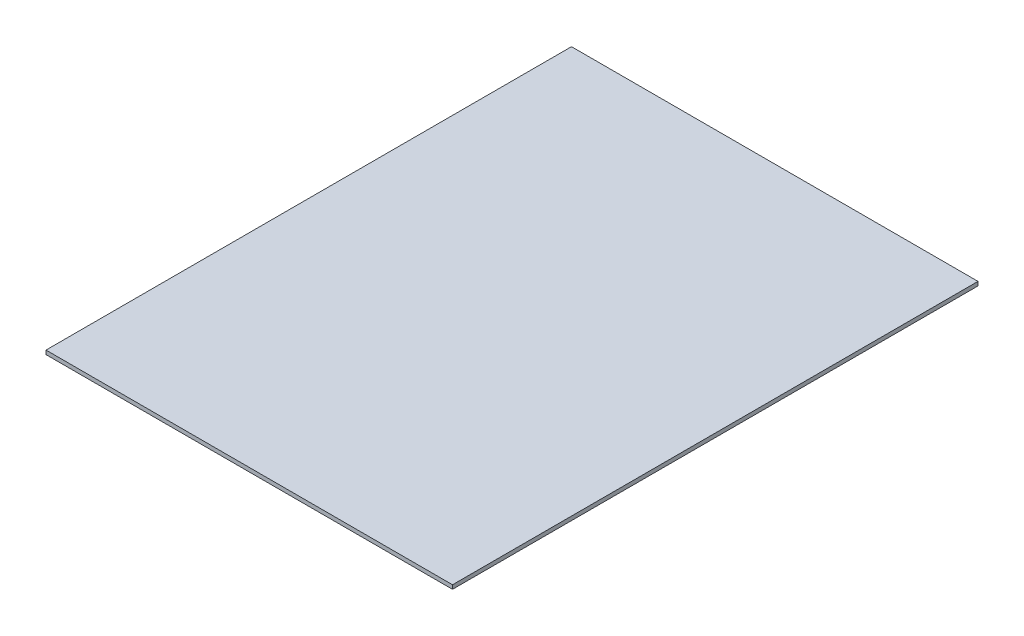
ISO-10303-21;
HEADER;
FILE_DESCRIPTION(('STEP AP214'),'2;1');
FILE_NAME('part.step','',(''),(''),'','','');
FILE_SCHEMA(('AUTOMOTIVE_DESIGN { 1 0 10303 214 1 1 1 1 }'));
ENDSEC;
DATA;
#1=APPLICATION_CONTEXT('core data for automotive mechanical design processes');
#2=APPLICATION_PROTOCOL_DEFINITION('international standard','automotive_design',2000,#1);
#3=PRODUCT_CONTEXT('',#1,'mechanical');
#4=PRODUCT('Part','Part','',(#3));
#5=PRODUCT_RELATED_PRODUCT_CATEGORY('part','',(#4));
#6=PRODUCT_DEFINITION_FORMATION('','',#4);
#7=PRODUCT_DEFINITION_CONTEXT('part definition',#1,'design');
#8=PRODUCT_DEFINITION('design','',#6,#7);
#9=PRODUCT_DEFINITION_SHAPE('','',#8);
#10=(LENGTH_UNIT() NAMED_UNIT(*) SI_UNIT(.MILLI.,.METRE.));
#11=(NAMED_UNIT(*) PLANE_ANGLE_UNIT() SI_UNIT($,.RADIAN.));
#12=(NAMED_UNIT(*) SI_UNIT($,.STERADIAN.) SOLID_ANGLE_UNIT());
#13=UNCERTAINTY_MEASURE_WITH_UNIT(LENGTH_MEASURE(1.E-05),#10,'distance_accuracy_value','');
#14=(GEOMETRIC_REPRESENTATION_CONTEXT(3) GLOBAL_UNCERTAINTY_ASSIGNED_CONTEXT((#13)) GLOBAL_UNIT_ASSIGNED_CONTEXT((#10,
#11,#12)) REPRESENTATION_CONTEXT('',''));
#15=CARTESIAN_POINT('',(0.,0.,0.));
#16=DIRECTION('',(0.,0.,1.));
#17=DIRECTION('',(1.,0.,0.));
#18=AXIS2_PLACEMENT_3D('',#15,#16,#17);
#19=CARTESIAN_POINT('',(0.,5.08,0.));
#20=DIRECTION('',(1.,0.,0.));
#21=DIRECTION('',(0.,0.,-1.));
#22=AXIS2_PLACEMENT_3D('',#19,#20,#21);
#23=PLANE('',#22);
#24=DIRECTION('',(0.,0.,1.));
#25=VECTOR('',#24,1.);
#26=CARTESIAN_POINT('',(0.,0.,0.));
#27=LINE('',#26,#25);
#28=CARTESIAN_POINT('',(0.,0.,0.));
#29=VERTEX_POINT('',#28);
#30=CARTESIAN_POINT('',(0.,0.,673.1));
#31=VERTEX_POINT('',#30);
#32=EDGE_CURVE('E96',#29,#31,#27,.T.);
#33=ORIENTED_EDGE('',*,*,#32,.T.);
#34=DIRECTION('',(0.,-1.,0.));
#35=VECTOR('',#34,1.);
#36=CARTESIAN_POINT('',(0.,5.08,673.1));
#37=LINE('',#36,#35);
#38=CARTESIAN_POINT('',(0.,5.08,673.1));
#39=VERTEX_POINT('',#38);
#40=EDGE_CURVE('E11',#39,#31,#37,.T.);
#41=ORIENTED_EDGE('',*,*,#40,.F.);
#42=DIRECTION('',(0.,0.,1.));
#43=VECTOR('',#42,1.);
#44=CARTESIAN_POINT('',(0.,5.08,0.));
#45=LINE('',#44,#43);
#46=CARTESIAN_POINT('',(0.,5.08,0.));
#47=VERTEX_POINT('',#46);
#48=EDGE_CURVE('E84',#47,#39,#45,.T.);
#49=ORIENTED_EDGE('',*,*,#48,.F.);
#50=DIRECTION('',(0.,-1.,0.));
#51=VECTOR('',#50,1.);
#52=CARTESIAN_POINT('',(0.,5.08,0.));
#53=LINE('',#52,#51);
#54=EDGE_CURVE('E92',#47,#29,#53,.T.);
#55=ORIENTED_EDGE('',*,*,#54,.T.);
#56=EDGE_LOOP('',(#33,#41,#49,#55));
#57=FACE_BOUND('',#56,.T.);
#58=ADVANCED_FACE('F33',(#57),#23,.F.);
#59=CARTESIAN_POINT('',(0.,5.08,673.1));
#60=DIRECTION('',(0.,0.,-1.));
#61=DIRECTION('',(-1.,0.,0.));
#62=AXIS2_PLACEMENT_3D('',#59,#60,#61);
#63=PLANE('',#62);
#64=DIRECTION('',(1.,0.,0.));
#65=VECTOR('',#64,1.);
#66=CARTESIAN_POINT('',(0.,0.,673.1));
#67=LINE('',#66,#65);
#68=CARTESIAN_POINT('',(520.7,0.,673.1));
#69=VERTEX_POINT('',#68);
#70=EDGE_CURVE('E88',#31,#69,#67,.T.);
#71=ORIENTED_EDGE('',*,*,#70,.T.);
#72=DIRECTION('',(0.,-1.,0.));
#73=VECTOR('',#72,1.);
#74=CARTESIAN_POINT('',(520.7,5.08,673.1));
#75=LINE('',#74,#73);
#76=CARTESIAN_POINT('',(520.7,5.08,673.1));
#77=VERTEX_POINT('',#76);
#78=EDGE_CURVE('E41',#77,#69,#75,.T.);
#79=ORIENTED_EDGE('',*,*,#78,.F.);
#80=DIRECTION('',(1.,0.,0.));
#81=VECTOR('',#80,1.);
#82=CARTESIAN_POINT('',(0.,5.08,673.1));
#83=LINE('',#82,#81);
#84=EDGE_CURVE('E79',#39,#77,#83,.T.);
#85=ORIENTED_EDGE('',*,*,#84,.F.);
#86=ORIENTED_EDGE('',*,*,#40,.T.);
#87=EDGE_LOOP('',(#71,#79,#85,#86));
#88=FACE_BOUND('',#87,.T.);
#89=ADVANCED_FACE('F87',(#88),#63,.F.);
#90=CARTESIAN_POINT('',(520.7,5.08,0.));
#91=DIRECTION('',(-1.,0.,0.));
#92=DIRECTION('',(0.,0.,1.));
#93=AXIS2_PLACEMENT_3D('',#90,#91,#92);
#94=PLANE('',#93);
#95=DIRECTION('',(0.,0.,-1.));
#96=VECTOR('',#95,1.);
#97=CARTESIAN_POINT('',(520.7,0.,0.));
#98=LINE('',#97,#96);
#99=CARTESIAN_POINT('',(520.7,0.,0.));
#100=VERTEX_POINT('',#99);
#101=EDGE_CURVE('E66',#69,#100,#98,.T.);
#102=ORIENTED_EDGE('',*,*,#101,.T.);
#103=DIRECTION('',(0.,-1.,0.));
#104=VECTOR('',#103,1.);
#105=CARTESIAN_POINT('',(520.7,5.08,0.));
#106=LINE('',#105,#104);
#107=CARTESIAN_POINT('',(520.7,5.08,0.));
#108=VERTEX_POINT('',#107);
#109=EDGE_CURVE('E89',#108,#100,#106,.T.);
#110=ORIENTED_EDGE('',*,*,#109,.F.);
#111=DIRECTION('',(0.,0.,-1.));
#112=VECTOR('',#111,1.);
#113=CARTESIAN_POINT('',(520.7,5.08,0.));
#114=LINE('',#113,#112);
#115=EDGE_CURVE('E82',#77,#108,#114,.T.);
#116=ORIENTED_EDGE('',*,*,#115,.F.);
#117=ORIENTED_EDGE('',*,*,#78,.T.);
#118=EDGE_LOOP('',(#102,#110,#116,#117));
#119=FACE_BOUND('',#118,.T.);
#120=ADVANCED_FACE('F90',(#119),#94,.F.);
#121=CARTESIAN_POINT('',(0.,5.08,0.));
#122=DIRECTION('',(0.,0.,1.));
#123=DIRECTION('',(1.,0.,0.));
#124=AXIS2_PLACEMENT_3D('',#121,#122,#123);
#125=PLANE('',#124);
#126=DIRECTION('',(-1.,0.,0.));
#127=VECTOR('',#126,1.);
#128=CARTESIAN_POINT('',(0.,0.,0.));
#129=LINE('',#128,#127);
#130=EDGE_CURVE('E72',#100,#29,#129,.T.);
#131=ORIENTED_EDGE('',*,*,#130,.T.);
#132=ORIENTED_EDGE('',*,*,#54,.F.);
#133=DIRECTION('',(-1.,0.,0.));
#134=VECTOR('',#133,1.);
#135=CARTESIAN_POINT('',(0.,5.08,0.));
#136=LINE('',#135,#134);
#137=EDGE_CURVE('E49',#108,#47,#136,.T.);
#138=ORIENTED_EDGE('',*,*,#137,.F.);
#139=ORIENTED_EDGE('',*,*,#109,.T.);
#140=EDGE_LOOP('',(#131,#132,#138,#139));
#141=FACE_BOUND('',#140,.T.);
#142=ADVANCED_FACE('F103',(#141),#125,.F.);
#143=CARTESIAN_POINT('',(0.,5.08,0.));
#144=DIRECTION('',(0.,1.,0.));
#145=DIRECTION('',(0.,0.,1.));
#146=AXIS2_PLACEMENT_3D('',#143,#144,#145);
#147=PLANE('',#146);
#148=ORIENTED_EDGE('',*,*,#48,.T.);
#149=ORIENTED_EDGE('',*,*,#84,.T.);
#150=ORIENTED_EDGE('',*,*,#115,.T.);
#151=ORIENTED_EDGE('',*,*,#137,.T.);
#152=EDGE_LOOP('',(#148,#149,#150,#151));
#153=FACE_BOUND('',#152,.T.);
#154=ADVANCED_FACE('F80',(#153),#147,.T.);
#155=CARTESIAN_POINT('',(0.,0.,0.));
#156=DIRECTION('',(0.,1.,0.));
#157=DIRECTION('',(0.,0.,1.));
#158=AXIS2_PLACEMENT_3D('',#155,#156,#157);
#159=PLANE('',#158);
#160=ORIENTED_EDGE('',*,*,#32,.F.);
#161=ORIENTED_EDGE('',*,*,#130,.F.);
#162=ORIENTED_EDGE('',*,*,#101,.F.);
#163=ORIENTED_EDGE('',*,*,#70,.F.);
#164=EDGE_LOOP('',(#160,#161,#162,#163));
#165=FACE_BOUND('',#164,.T.);
#166=ADVANCED_FACE('F106',(#165),#159,.F.);
#167=CLOSED_SHELL('',(#58,#89,#120,#142,#154,#166));
#168=MANIFOLD_SOLID_BREP('B2',#167);
#169=ADVANCED_BREP_SHAPE_REPRESENTATION('',(#18,#168),#14);
#170=SHAPE_DEFINITION_REPRESENTATION(#9,#169);
ENDSEC;
END-ISO-10303-21;
